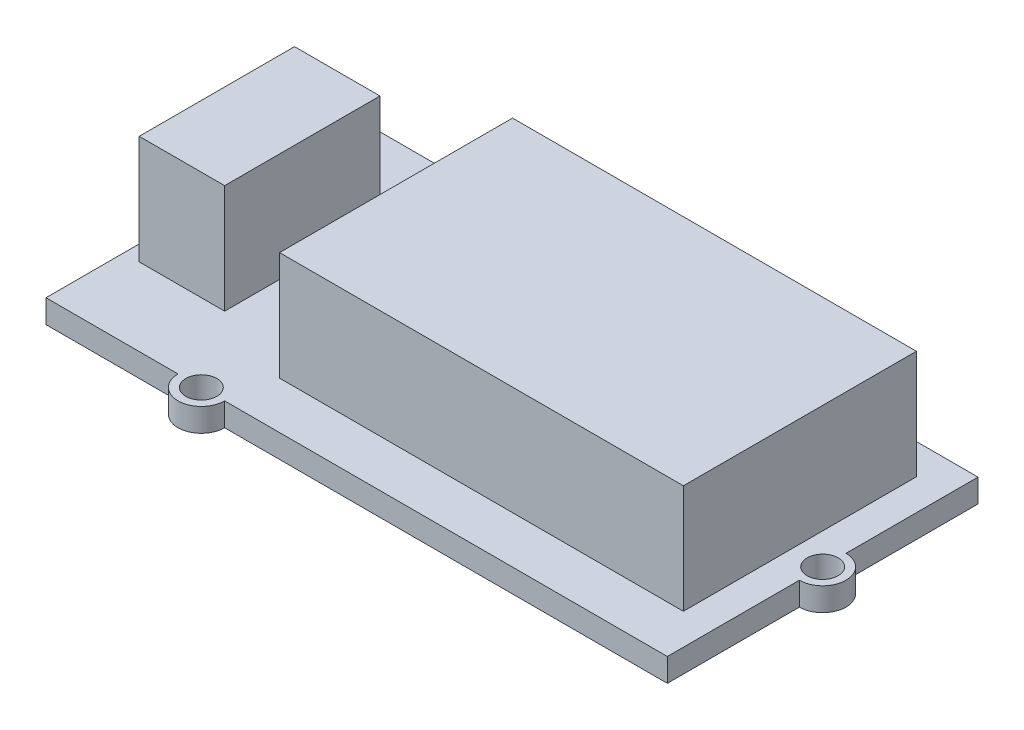
ISO-10303-21;
HEADER;
FILE_DESCRIPTION(('STEP AP214'),'2;1');
FILE_NAME('part.step','',(''),(''),'','','');
FILE_SCHEMA(('AUTOMOTIVE_DESIGN { 1 0 10303 214 1 1 1 1 }'));
ENDSEC;
DATA;
#1=APPLICATION_CONTEXT('core data for automotive mechanical design processes');
#2=APPLICATION_PROTOCOL_DEFINITION('international standard','automotive_design',2000,#1);
#3=PRODUCT_CONTEXT('',#1,'mechanical');
#4=PRODUCT('Part','Part','',(#3));
#5=PRODUCT_RELATED_PRODUCT_CATEGORY('part','',(#4));
#6=PRODUCT_DEFINITION_FORMATION('','',#4);
#7=PRODUCT_DEFINITION_CONTEXT('part definition',#1,'design');
#8=PRODUCT_DEFINITION('design','',#6,#7);
#9=PRODUCT_DEFINITION_SHAPE('','',#8);
#10=(LENGTH_UNIT() NAMED_UNIT(*) SI_UNIT(.MILLI.,.METRE.));
#11=(NAMED_UNIT(*) PLANE_ANGLE_UNIT() SI_UNIT($,.RADIAN.));
#12=(NAMED_UNIT(*) SI_UNIT($,.STERADIAN.) SOLID_ANGLE_UNIT());
#13=UNCERTAINTY_MEASURE_WITH_UNIT(LENGTH_MEASURE(1.E-05),#10,'distance_accuracy_value','');
#14=(GEOMETRIC_REPRESENTATION_CONTEXT(3) GLOBAL_UNCERTAINTY_ASSIGNED_CONTEXT((#13)) GLOBAL_UNIT_ASSIGNED_CONTEXT((#10,
#11,#12)) REPRESENTATION_CONTEXT('',''));
#15=CARTESIAN_POINT('',(0.,0.,0.));
#16=DIRECTION('',(0.,0.,1.));
#17=DIRECTION('',(1.,0.,0.));
#18=AXIS2_PLACEMENT_3D('',#15,#16,#17);
#19=CARTESIAN_POINT('',(0.,1.5,0.));
#20=DIRECTION('',(0.,1.,0.));
#21=DIRECTION('',(0.,0.,1.));
#22=AXIS2_PLACEMENT_3D('',#19,#20,#21);
#23=PLANE('',#22);
#24=CARTESIAN_POINT('',(-10.,1.5,-10.));
#25=DIRECTION('',(0.,1.,0.));
#26=DIRECTION('',(0.,0.,1.));
#27=AXIS2_PLACEMENT_3D('',#24,#25,#26);
#28=CIRCLE('',#27,1.);
#29=CARTESIAN_POINT('',(-10.,1.5,-9.));
#30=VERTEX_POINT('',#29);
#31=EDGE_CURVE('E215',#30,#30,#28,.T.);
#32=ORIENTED_EDGE('',*,*,#31,.F.);
#33=EDGE_LOOP('',(#32));
#34=FACE_BOUND('',#33,.T.);
#35=CARTESIAN_POINT('',(20.,1.5,0.));
#36=DIRECTION('',(0.,1.,0.));
#37=DIRECTION('',(0.,0.,1.));
#38=AXIS2_PLACEMENT_3D('',#35,#36,#37);
#39=CIRCLE('',#38,1.);
#40=CARTESIAN_POINT('',(20.,1.5,1.));
#41=VERTEX_POINT('',#40);
#42=EDGE_CURVE('E219',#41,#41,#39,.T.);
#43=ORIENTED_EDGE('',*,*,#42,.F.);
#44=EDGE_LOOP('',(#43));
#45=FACE_BOUND('',#44,.T.);
#46=CARTESIAN_POINT('',(-10.,1.5,10.));
#47=DIRECTION('',(0.,1.,0.));
#48=DIRECTION('',(0.,0.,1.));
#49=AXIS2_PLACEMENT_3D('',#46,#47,#48);
#50=CIRCLE('',#49,0.999999999999999);
#51=CARTESIAN_POINT('',(-10.,1.5,11.));
#52=VERTEX_POINT('',#51);
#53=EDGE_CURVE('E225',#52,#52,#50,.T.);
#54=ORIENTED_EDGE('',*,*,#53,.F.);
#55=EDGE_LOOP('',(#54));
#56=FACE_BOUND('',#55,.T.);
#57=DIRECTION('',(0.,0.,-1.));
#58=VECTOR('',#57,1.);
#59=CARTESIAN_POINT('',(20.,1.5,-10.));
#60=LINE('',#59,#58);
#61=CARTESIAN_POINT('',(20.,1.5,10.));
#62=VERTEX_POINT('',#61);
#63=CARTESIAN_POINT('',(20.,1.5,1.5));
#64=VERTEX_POINT('',#63);
#65=EDGE_CURVE('E264',#62,#64,#60,.T.);
#66=ORIENTED_EDGE('',*,*,#65,.T.);
#67=CARTESIAN_POINT('',(20.,1.5,0.));
#68=DIRECTION('',(0.,1.,0.));
#69=DIRECTION('',(0.,0.,1.));
#70=AXIS2_PLACEMENT_3D('',#67,#68,#69);
#71=CIRCLE('',#70,1.5);
#72=CARTESIAN_POINT('',(20.,1.5,-1.5));
#73=VERTEX_POINT('',#72);
#74=EDGE_CURVE('E231',#64,#73,#71,.T.);
#75=ORIENTED_EDGE('',*,*,#74,.T.);
#76=CARTESIAN_POINT('',(20.,1.5,-10.));
#77=VERTEX_POINT('',#76);
#78=EDGE_CURVE('E268',#73,#77,#60,.T.);
#79=ORIENTED_EDGE('',*,*,#78,.T.);
#80=DIRECTION('',(-1.,0.,0.));
#81=VECTOR('',#80,1.);
#82=CARTESIAN_POINT('',(-20.,1.5,-10.));
#83=LINE('',#82,#81);
#84=CARTESIAN_POINT('',(-8.5,1.5,-10.));
#85=VERTEX_POINT('',#84);
#86=EDGE_CURVE('E269',#77,#85,#83,.T.);
#87=ORIENTED_EDGE('',*,*,#86,.T.);
#88=CARTESIAN_POINT('',(-10.,1.5,-10.));
#89=DIRECTION('',(0.,1.,0.));
#90=DIRECTION('',(0.,0.,1.));
#91=AXIS2_PLACEMENT_3D('',#88,#89,#90);
#92=CIRCLE('',#91,1.5);
#93=CARTESIAN_POINT('',(-11.5,1.5,-10.));
#94=VERTEX_POINT('',#93);
#95=EDGE_CURVE('E253',#85,#94,#92,.T.);
#96=ORIENTED_EDGE('',*,*,#95,.T.);
#97=CARTESIAN_POINT('',(-20.,1.5,-10.));
#98=VERTEX_POINT('',#97);
#99=EDGE_CURVE('E267',#94,#98,#83,.T.);
#100=ORIENTED_EDGE('',*,*,#99,.T.);
#101=DIRECTION('',(0.,0.,1.));
#102=VECTOR('',#101,1.);
#103=CARTESIAN_POINT('',(-20.,1.5,-10.));
#104=LINE('',#103,#102);
#105=CARTESIAN_POINT('',(-20.,1.5,10.));
#106=VERTEX_POINT('',#105);
#107=EDGE_CURVE('E272',#98,#106,#104,.T.);
#108=ORIENTED_EDGE('',*,*,#107,.T.);
#109=DIRECTION('',(1.,0.,0.));
#110=VECTOR('',#109,1.);
#111=CARTESIAN_POINT('',(-20.,1.5,10.));
#112=LINE('',#111,#110);
#113=CARTESIAN_POINT('',(-11.5,1.5,10.));
#114=VERTEX_POINT('',#113);
#115=EDGE_CURVE('E275',#106,#114,#112,.T.);
#116=ORIENTED_EDGE('',*,*,#115,.T.);
#117=CARTESIAN_POINT('',(-10.,1.5,10.));
#118=DIRECTION('',(0.,1.,0.));
#119=DIRECTION('',(0.,0.,1.));
#120=AXIS2_PLACEMENT_3D('',#117,#118,#119);
#121=CIRCLE('',#120,1.5);
#122=CARTESIAN_POINT('',(-8.5,1.5,10.));
#123=VERTEX_POINT('',#122);
#124=EDGE_CURVE('E243',#114,#123,#121,.T.);
#125=ORIENTED_EDGE('',*,*,#124,.T.);
#126=EDGE_CURVE('E274',#123,#62,#112,.T.);
#127=ORIENTED_EDGE('',*,*,#126,.T.);
#128=EDGE_LOOP('',(#66,#75,#79,#87,#96,#100,#108,#116,#125,#127));
#129=FACE_BOUND('',#128,.T.);
#130=DIRECTION('',(-1.,0.,0.));
#131=VECTOR('',#130,1.);
#132=CARTESIAN_POINT('',(-19.,1.5,-5.));
#133=LINE('',#132,#131);
#134=CARTESIAN_POINT('',(-13.5,1.5,-5.));
#135=VERTEX_POINT('',#134);
#136=CARTESIAN_POINT('',(-19.,1.5,-5.));
#137=VERTEX_POINT('',#136);
#138=EDGE_CURVE('E187',#135,#137,#133,.T.);
#139=ORIENTED_EDGE('',*,*,#138,.F.);
#140=DIRECTION('',(0.,0.,-1.));
#141=VECTOR('',#140,1.);
#142=CARTESIAN_POINT('',(-13.5,1.5,-5.));
#143=LINE('',#142,#141);
#144=CARTESIAN_POINT('',(-13.5,1.5,5.));
#145=VERTEX_POINT('',#144);
#146=EDGE_CURVE('E184',#145,#135,#143,.T.);
#147=ORIENTED_EDGE('',*,*,#146,.F.);
#148=DIRECTION('',(1.,0.,0.));
#149=VECTOR('',#148,1.);
#150=CARTESIAN_POINT('',(-19.,1.5,5.));
#151=LINE('',#150,#149);
#152=CARTESIAN_POINT('',(-19.,1.5,5.));
#153=VERTEX_POINT('',#152);
#154=EDGE_CURVE('E196',#153,#145,#151,.T.);
#155=ORIENTED_EDGE('',*,*,#154,.F.);
#156=DIRECTION('',(0.,0.,1.));
#157=VECTOR('',#156,1.);
#158=CARTESIAN_POINT('',(-19.,1.5,-5.));
#159=LINE('',#158,#157);
#160=EDGE_CURVE('E204',#137,#153,#159,.T.);
#161=ORIENTED_EDGE('',*,*,#160,.F.);
#162=EDGE_LOOP('',(#139,#147,#155,#161));
#163=FACE_BOUND('',#162,.T.);
#164=DIRECTION('',(-1.,0.,0.));
#165=VECTOR('',#164,1.);
#166=CARTESIAN_POINT('',(-8.,1.5,-8.03388581005038));
#167=LINE('',#166,#165);
#168=CARTESIAN_POINT('',(18.,1.5,-8.03388581005038));
#169=VERTEX_POINT('',#168);
#170=CARTESIAN_POINT('',(-8.,1.5,-8.03388581005038));
#171=VERTEX_POINT('',#170);
#172=EDGE_CURVE('E559',#169,#171,#167,.T.);
#173=ORIENTED_EDGE('',*,*,#172,.F.);
#174=DIRECTION('',(0.,0.,-1.));
#175=VECTOR('',#174,1.);
#176=CARTESIAN_POINT('',(18.,1.5,-8.03388581005038));
#177=LINE('',#176,#175);
#178=CARTESIAN_POINT('',(18.,1.5,6.96611418994962));
#179=VERTEX_POINT('',#178);
#180=EDGE_CURVE('E182',#179,#169,#177,.T.);
#181=ORIENTED_EDGE('',*,*,#180,.F.);
#182=DIRECTION('',(1.,0.,0.));
#183=VECTOR('',#182,1.);
#184=CARTESIAN_POINT('',(-8.,1.5,6.96611418994962));
#185=LINE('',#184,#183);
#186=CARTESIAN_POINT('',(-8.,1.5,6.96611418994962));
#187=VERTEX_POINT('',#186);
#188=EDGE_CURVE('E178',#187,#179,#185,.T.);
#189=ORIENTED_EDGE('',*,*,#188,.F.);
#190=DIRECTION('',(0.,0.,1.));
#191=VECTOR('',#190,1.);
#192=CARTESIAN_POINT('',(-8.,1.5,-8.03388581005038));
#193=LINE('',#192,#191);
#194=EDGE_CURVE('E556',#171,#187,#193,.T.);
#195=ORIENTED_EDGE('',*,*,#194,.F.);
#196=EDGE_LOOP('',(#173,#181,#189,#195));
#197=FACE_BOUND('',#196,.T.);
#198=ADVANCED_FACE('F33',(#34,#45,#56,#129,#163,#197),#23,.T.);
#199=CARTESIAN_POINT('',(20.,1.5,-10.));
#200=DIRECTION('',(-1.,0.,0.));
#201=DIRECTION('',(0.,0.,1.));
#202=AXIS2_PLACEMENT_3D('',#199,#200,#201);
#203=PLANE('',#202);
#204=DIRECTION('',(0.,0.,-1.));
#205=VECTOR('',#204,1.);
#206=CARTESIAN_POINT('',(20.,0.,-10.));
#207=LINE('',#206,#205);
#208=CARTESIAN_POINT('',(20.,0.,10.));
#209=VERTEX_POINT('',#208);
#210=CARTESIAN_POINT('',(20.,0.,1.5));
#211=VERTEX_POINT('',#210);
#212=EDGE_CURVE('E279',#209,#211,#207,.T.);
#213=ORIENTED_EDGE('',*,*,#212,.T.);
#214=DIRECTION('',(0.,1.,0.));
#215=VECTOR('',#214,1.);
#216=CARTESIAN_POINT('',(20.,0.,1.5));
#217=LINE('',#216,#215);
#218=EDGE_CURVE('E240',#211,#64,#217,.T.);
#219=ORIENTED_EDGE('',*,*,#218,.T.);
#220=ORIENTED_EDGE('',*,*,#65,.F.);
#221=DIRECTION('',(0.,-1.,0.));
#222=VECTOR('',#221,1.);
#223=CARTESIAN_POINT('',(20.,1.5,10.));
#224=LINE('',#223,#222);
#225=EDGE_CURVE('E278',#62,#209,#224,.T.);
#226=ORIENTED_EDGE('',*,*,#225,.T.);
#227=EDGE_LOOP('',(#213,#219,#220,#226));
#228=FACE_BOUND('',#227,.T.);
#229=ADVANCED_FACE('F335',(#228),#203,.F.);
#230=CARTESIAN_POINT('',(-20.,1.5,10.));
#231=DIRECTION('',(0.,0.,-1.));
#232=DIRECTION('',(-1.,0.,0.));
#233=AXIS2_PLACEMENT_3D('',#230,#231,#232);
#234=PLANE('',#233);
#235=DIRECTION('',(1.,0.,0.));
#236=VECTOR('',#235,1.);
#237=CARTESIAN_POINT('',(-20.,0.,10.));
#238=LINE('',#237,#236);
#239=CARTESIAN_POINT('',(-20.,0.,10.));
#240=VERTEX_POINT('',#239);
#241=CARTESIAN_POINT('',(-11.5,0.,10.));
#242=VERTEX_POINT('',#241);
#243=EDGE_CURVE('E289',#240,#242,#238,.T.);
#244=ORIENTED_EDGE('',*,*,#243,.T.);
#245=DIRECTION('',(0.,1.,0.));
#246=VECTOR('',#245,1.);
#247=CARTESIAN_POINT('',(-11.5,0.,10.));
#248=LINE('',#247,#246);
#249=EDGE_CURVE('E250',#242,#114,#248,.T.);
#250=ORIENTED_EDGE('',*,*,#249,.T.);
#251=ORIENTED_EDGE('',*,*,#115,.F.);
#252=DIRECTION('',(0.,-1.,0.));
#253=VECTOR('',#252,1.);
#254=CARTESIAN_POINT('',(-20.,1.5,10.));
#255=LINE('',#254,#253);
#256=EDGE_CURVE('E294',#106,#240,#255,.T.);
#257=ORIENTED_EDGE('',*,*,#256,.T.);
#258=EDGE_LOOP('',(#244,#250,#251,#257));
#259=FACE_BOUND('',#258,.T.);
#260=ADVANCED_FACE('F314',(#259),#234,.F.);
#261=CARTESIAN_POINT('',(-20.,1.5,-10.));
#262=DIRECTION('',(0.,0.,1.));
#263=DIRECTION('',(1.,0.,0.));
#264=AXIS2_PLACEMENT_3D('',#261,#262,#263);
#265=PLANE('',#264);
#266=DIRECTION('',(-1.,0.,0.));
#267=VECTOR('',#266,1.);
#268=CARTESIAN_POINT('',(-20.,0.,-10.));
#269=LINE('',#268,#267);
#270=CARTESIAN_POINT('',(20.,0.,-10.));
#271=VERTEX_POINT('',#270);
#272=CARTESIAN_POINT('',(-8.5,0.,-10.));
#273=VERTEX_POINT('',#272);
#274=EDGE_CURVE('E283',#271,#273,#269,.T.);
#275=ORIENTED_EDGE('',*,*,#274,.T.);
#276=DIRECTION('',(0.,1.,0.));
#277=VECTOR('',#276,1.);
#278=CARTESIAN_POINT('',(-8.5,0.,-10.));
#279=LINE('',#278,#277);
#280=EDGE_CURVE('E260',#273,#85,#279,.T.);
#281=ORIENTED_EDGE('',*,*,#280,.T.);
#282=ORIENTED_EDGE('',*,*,#86,.F.);
#283=DIRECTION('',(0.,-1.,0.));
#284=VECTOR('',#283,1.);
#285=CARTESIAN_POINT('',(20.,1.5,-10.));
#286=LINE('',#285,#284);
#287=EDGE_CURVE('E11',#77,#271,#286,.T.);
#288=ORIENTED_EDGE('',*,*,#287,.T.);
#289=EDGE_LOOP('',(#275,#281,#282,#288));
#290=FACE_BOUND('',#289,.T.);
#291=ADVANCED_FACE('F325',(#290),#265,.F.);
#292=ORIENTED_EDGE('',*,*,#78,.F.);
#293=DIRECTION('',(0.,1.,0.));
#294=VECTOR('',#293,1.);
#295=CARTESIAN_POINT('',(20.,0.,-1.5));
#296=LINE('',#295,#294);
#297=CARTESIAN_POINT('',(20.,0.,-1.5));
#298=VERTEX_POINT('',#297);
#299=EDGE_CURVE('E236',#73,#298,#296,.F.);
#300=ORIENTED_EDGE('',*,*,#299,.T.);
#301=EDGE_CURVE('E263',#298,#271,#207,.T.);
#302=ORIENTED_EDGE('',*,*,#301,.T.);
#303=ORIENTED_EDGE('',*,*,#287,.F.);
#304=EDGE_LOOP('',(#292,#300,#302,#303));
#305=FACE_BOUND('',#304,.T.);
#306=ADVANCED_FACE('F35',(#305),#203,.F.);
#307=ORIENTED_EDGE('',*,*,#99,.F.);
#308=DIRECTION('',(0.,1.,0.));
#309=VECTOR('',#308,1.);
#310=CARTESIAN_POINT('',(-11.5,0.,-10.));
#311=LINE('',#310,#309);
#312=CARTESIAN_POINT('',(-11.5,0.,-10.));
#313=VERTEX_POINT('',#312);
#314=EDGE_CURVE('E256',#94,#313,#311,.F.);
#315=ORIENTED_EDGE('',*,*,#314,.T.);
#316=CARTESIAN_POINT('',(-20.,0.,-10.));
#317=VERTEX_POINT('',#316);
#318=EDGE_CURVE('E282',#313,#317,#269,.T.);
#319=ORIENTED_EDGE('',*,*,#318,.T.);
#320=DIRECTION('',(0.,-1.,0.));
#321=VECTOR('',#320,1.);
#322=CARTESIAN_POINT('',(-20.,1.5,-10.));
#323=LINE('',#322,#321);
#324=EDGE_CURVE('E41',#98,#317,#323,.T.);
#325=ORIENTED_EDGE('',*,*,#324,.F.);
#326=EDGE_LOOP('',(#307,#315,#319,#325));
#327=FACE_BOUND('',#326,.T.);
#328=ADVANCED_FACE('F320',(#327),#265,.F.);
#329=CARTESIAN_POINT('',(-20.,1.5,-10.));
#330=DIRECTION('',(1.,0.,0.));
#331=DIRECTION('',(0.,0.,-1.));
#332=AXIS2_PLACEMENT_3D('',#329,#330,#331);
#333=PLANE('',#332);
#334=DIRECTION('',(0.,0.,1.));
#335=VECTOR('',#334,1.);
#336=CARTESIAN_POINT('',(-20.,0.,-10.));
#337=LINE('',#336,#335);
#338=EDGE_CURVE('E286',#317,#240,#337,.T.);
#339=ORIENTED_EDGE('',*,*,#338,.T.);
#340=ORIENTED_EDGE('',*,*,#256,.F.);
#341=ORIENTED_EDGE('',*,*,#107,.F.);
#342=ORIENTED_EDGE('',*,*,#324,.T.);
#343=EDGE_LOOP('',(#339,#340,#341,#342));
#344=FACE_BOUND('',#343,.T.);
#345=ADVANCED_FACE('F301',(#344),#333,.F.);
#346=ORIENTED_EDGE('',*,*,#126,.F.);
#347=DIRECTION('',(0.,1.,0.));
#348=VECTOR('',#347,1.);
#349=CARTESIAN_POINT('',(-8.5,0.,10.));
#350=LINE('',#349,#348);
#351=CARTESIAN_POINT('',(-8.5,0.,10.));
#352=VERTEX_POINT('',#351);
#353=EDGE_CURVE('E246',#123,#352,#350,.F.);
#354=ORIENTED_EDGE('',*,*,#353,.T.);
#355=EDGE_CURVE('E288',#352,#209,#238,.T.);
#356=ORIENTED_EDGE('',*,*,#355,.T.);
#357=ORIENTED_EDGE('',*,*,#225,.F.);
#358=EDGE_LOOP('',(#346,#354,#356,#357));
#359=FACE_BOUND('',#358,.T.);
#360=ADVANCED_FACE('F340',(#359),#234,.F.);
#361=CARTESIAN_POINT('',(0.,0.,0.));
#362=DIRECTION('',(0.,1.,0.));
#363=DIRECTION('',(0.,0.,1.));
#364=AXIS2_PLACEMENT_3D('',#361,#362,#363);
#365=PLANE('',#364);
#366=CARTESIAN_POINT('',(-10.,0.,-10.));
#367=DIRECTION('',(0.,1.,0.));
#368=DIRECTION('',(0.,0.,1.));
#369=AXIS2_PLACEMENT_3D('',#366,#367,#368);
#370=CIRCLE('',#369,1.);
#371=CARTESIAN_POINT('',(-10.,0.,-9.));
#372=VERTEX_POINT('',#371);
#373=EDGE_CURVE('E216',#372,#372,#370,.T.);
#374=ORIENTED_EDGE('',*,*,#373,.T.);
#375=EDGE_LOOP('',(#374));
#376=FACE_BOUND('',#375,.T.);
#377=CARTESIAN_POINT('',(20.,0.,0.));
#378=DIRECTION('',(0.,1.,0.));
#379=DIRECTION('',(0.,0.,1.));
#380=AXIS2_PLACEMENT_3D('',#377,#378,#379);
#381=CIRCLE('',#380,1.);
#382=CARTESIAN_POINT('',(20.,0.,1.));
#383=VERTEX_POINT('',#382);
#384=EDGE_CURVE('E222',#383,#383,#381,.T.);
#385=ORIENTED_EDGE('',*,*,#384,.T.);
#386=EDGE_LOOP('',(#385));
#387=FACE_BOUND('',#386,.T.);
#388=CARTESIAN_POINT('',(-10.,0.,10.));
#389=DIRECTION('',(0.,1.,0.));
#390=DIRECTION('',(0.,0.,1.));
#391=AXIS2_PLACEMENT_3D('',#388,#389,#390);
#392=CIRCLE('',#391,0.999999999999999);
#393=CARTESIAN_POINT('',(-10.,0.,11.));
#394=VERTEX_POINT('',#393);
#395=EDGE_CURVE('E228',#394,#394,#392,.T.);
#396=ORIENTED_EDGE('',*,*,#395,.T.);
#397=EDGE_LOOP('',(#396));
#398=FACE_BOUND('',#397,.T.);
#399=ORIENTED_EDGE('',*,*,#301,.F.);
#400=CARTESIAN_POINT('',(20.,0.,0.));
#401=DIRECTION('',(0.,1.,0.));
#402=DIRECTION('',(0.,0.,1.));
#403=AXIS2_PLACEMENT_3D('',#400,#401,#402);
#404=CIRCLE('',#403,1.5);
#405=EDGE_CURVE('E234',#211,#298,#404,.T.);
#406=ORIENTED_EDGE('',*,*,#405,.F.);
#407=ORIENTED_EDGE('',*,*,#212,.F.);
#408=ORIENTED_EDGE('',*,*,#355,.F.);
#409=CARTESIAN_POINT('',(-10.,0.,10.));
#410=DIRECTION('',(0.,1.,0.));
#411=DIRECTION('',(0.,0.,1.));
#412=AXIS2_PLACEMENT_3D('',#409,#410,#411);
#413=CIRCLE('',#412,1.5);
#414=EDGE_CURVE('E244',#242,#352,#413,.T.);
#415=ORIENTED_EDGE('',*,*,#414,.F.);
#416=ORIENTED_EDGE('',*,*,#243,.F.);
#417=ORIENTED_EDGE('',*,*,#338,.F.);
#418=ORIENTED_EDGE('',*,*,#318,.F.);
#419=CARTESIAN_POINT('',(-10.,0.,-10.));
#420=DIRECTION('',(0.,1.,0.));
#421=DIRECTION('',(0.,0.,1.));
#422=AXIS2_PLACEMENT_3D('',#419,#420,#421);
#423=CIRCLE('',#422,1.5);
#424=EDGE_CURVE('E254',#273,#313,#423,.T.);
#425=ORIENTED_EDGE('',*,*,#424,.F.);
#426=ORIENTED_EDGE('',*,*,#274,.F.);
#427=EDGE_LOOP('',(#399,#406,#407,#408,#415,#416,#417,#418,#425,#426));
#428=FACE_BOUND('',#427,.T.);
#429=ADVANCED_FACE('F309',(#376,#387,#398,#428),#365,.F.);
#430=CARTESIAN_POINT('',(-10.,0.,-10.));
#431=DIRECTION('',(0.,1.,0.));
#432=DIRECTION('',(0.,0.,1.));
#433=AXIS2_PLACEMENT_3D('',#430,#431,#432);
#434=CYLINDRICAL_SURFACE('',#433,1.5);
#435=ORIENTED_EDGE('',*,*,#280,.F.);
#436=ORIENTED_EDGE('',*,*,#424,.T.);
#437=ORIENTED_EDGE('',*,*,#314,.F.);
#438=ORIENTED_EDGE('',*,*,#95,.F.);
#439=EDGE_LOOP('',(#435,#436,#437,#438));
#440=FACE_BOUND('',#439,.T.);
#441=ADVANCED_FACE('F322',(#440),#434,.T.);
#442=CARTESIAN_POINT('',(-10.,0.,10.));
#443=DIRECTION('',(0.,1.,0.));
#444=DIRECTION('',(0.,0.,1.));
#445=AXIS2_PLACEMENT_3D('',#442,#443,#444);
#446=CYLINDRICAL_SURFACE('',#445,1.5);
#447=ORIENTED_EDGE('',*,*,#249,.F.);
#448=ORIENTED_EDGE('',*,*,#414,.T.);
#449=ORIENTED_EDGE('',*,*,#353,.F.);
#450=ORIENTED_EDGE('',*,*,#124,.F.);
#451=EDGE_LOOP('',(#447,#448,#449,#450));
#452=FACE_BOUND('',#451,.T.);
#453=ADVANCED_FACE('F342',(#452),#446,.T.);
#454=CARTESIAN_POINT('',(20.,0.,0.));
#455=DIRECTION('',(0.,1.,0.));
#456=DIRECTION('',(0.,0.,1.));
#457=AXIS2_PLACEMENT_3D('',#454,#455,#456);
#458=CYLINDRICAL_SURFACE('',#457,1.5);
#459=ORIENTED_EDGE('',*,*,#218,.F.);
#460=ORIENTED_EDGE('',*,*,#405,.T.);
#461=ORIENTED_EDGE('',*,*,#299,.F.);
#462=ORIENTED_EDGE('',*,*,#74,.F.);
#463=EDGE_LOOP('',(#459,#460,#461,#462));
#464=FACE_BOUND('',#463,.T.);
#465=ADVANCED_FACE('F344',(#464),#458,.T.);
#466=CARTESIAN_POINT('',(-10.,0.,10.));
#467=DIRECTION('',(0.,1.,0.));
#468=DIRECTION('',(0.,0.,1.));
#469=AXIS2_PLACEMENT_3D('',#466,#467,#468);
#470=CYLINDRICAL_SURFACE('',#469,0.999999999999999);
#471=ORIENTED_EDGE('',*,*,#395,.F.);
#472=EDGE_LOOP('',(#471));
#473=FACE_BOUND('',#472,.T.);
#474=ORIENTED_EDGE('',*,*,#53,.T.);
#475=EDGE_LOOP('',(#474));
#476=FACE_BOUND('',#475,.T.);
#477=ADVANCED_FACE('F350',(#473,#476),#470,.F.);
#478=CARTESIAN_POINT('',(20.,0.,0.));
#479=DIRECTION('',(0.,1.,0.));
#480=DIRECTION('',(0.,0.,1.));
#481=AXIS2_PLACEMENT_3D('',#478,#479,#480);
#482=CYLINDRICAL_SURFACE('',#481,1.);
#483=ORIENTED_EDGE('',*,*,#384,.F.);
#484=EDGE_LOOP('',(#483));
#485=FACE_BOUND('',#484,.T.);
#486=ORIENTED_EDGE('',*,*,#42,.T.);
#487=EDGE_LOOP('',(#486));
#488=FACE_BOUND('',#487,.T.);
#489=ADVANCED_FACE('F423',(#485,#488),#482,.F.);
#490=CARTESIAN_POINT('',(-10.,0.,-10.));
#491=DIRECTION('',(0.,1.,0.));
#492=DIRECTION('',(0.,0.,1.));
#493=AXIS2_PLACEMENT_3D('',#490,#491,#492);
#494=CYLINDRICAL_SURFACE('',#493,1.);
#495=ORIENTED_EDGE('',*,*,#373,.F.);
#496=EDGE_LOOP('',(#495));
#497=FACE_BOUND('',#496,.T.);
#498=ORIENTED_EDGE('',*,*,#31,.T.);
#499=EDGE_LOOP('',(#498));
#500=FACE_BOUND('',#499,.T.);
#501=ADVANCED_FACE('F430',(#497,#500),#494,.F.);
#502=CARTESIAN_POINT('',(-13.5,8.5,-5.));
#503=DIRECTION('',(-1.,0.,0.));
#504=DIRECTION('',(0.,0.,1.));
#505=AXIS2_PLACEMENT_3D('',#502,#503,#504);
#506=PLANE('',#505);
#507=ORIENTED_EDGE('',*,*,#146,.T.);
#508=DIRECTION('',(0.,-1.,0.));
#509=VECTOR('',#508,1.);
#510=CARTESIAN_POINT('',(-13.5,8.5,-5.));
#511=LINE('',#510,#509);
#512=CARTESIAN_POINT('',(-13.5,8.5,-5.));
#513=VERTEX_POINT('',#512);
#514=EDGE_CURVE('E213',#513,#135,#511,.T.);
#515=ORIENTED_EDGE('',*,*,#514,.F.);
#516=DIRECTION('',(0.,0.,-1.));
#517=VECTOR('',#516,1.);
#518=CARTESIAN_POINT('',(-13.5,8.5,-5.));
#519=LINE('',#518,#517);
#520=CARTESIAN_POINT('',(-13.5,8.5,5.));
#521=VERTEX_POINT('',#520);
#522=EDGE_CURVE('E192',#521,#513,#519,.T.);
#523=ORIENTED_EDGE('',*,*,#522,.F.);
#524=DIRECTION('',(0.,-1.,0.));
#525=VECTOR('',#524,1.);
#526=CARTESIAN_POINT('',(-13.5,8.5,5.));
#527=LINE('',#526,#525);
#528=EDGE_CURVE('E201',#521,#145,#527,.T.);
#529=ORIENTED_EDGE('',*,*,#528,.T.);
#530=EDGE_LOOP('',(#507,#515,#523,#529));
#531=FACE_BOUND('',#530,.T.);
#532=ADVANCED_FACE('F438',(#531),#506,.F.);
#533=CARTESIAN_POINT('',(-19.,8.5,-5.));
#534=DIRECTION('',(0.,0.,1.));
#535=DIRECTION('',(1.,0.,0.));
#536=AXIS2_PLACEMENT_3D('',#533,#534,#535);
#537=PLANE('',#536);
#538=ORIENTED_EDGE('',*,*,#138,.T.);
#539=DIRECTION('',(0.,-1.,0.));
#540=VECTOR('',#539,1.);
#541=CARTESIAN_POINT('',(-19.,8.5,-5.));
#542=LINE('',#541,#540);
#543=CARTESIAN_POINT('',(-19.,8.5,-5.));
#544=VERTEX_POINT('',#543);
#545=EDGE_CURVE('E210',#544,#137,#542,.T.);
#546=ORIENTED_EDGE('',*,*,#545,.F.);
#547=DIRECTION('',(-1.,0.,0.));
#548=VECTOR('',#547,1.);
#549=CARTESIAN_POINT('',(-19.,8.5,-5.));
#550=LINE('',#549,#548);
#551=EDGE_CURVE('E195',#513,#544,#550,.T.);
#552=ORIENTED_EDGE('',*,*,#551,.F.);
#553=ORIENTED_EDGE('',*,*,#514,.T.);
#554=EDGE_LOOP('',(#538,#546,#552,#553));
#555=FACE_BOUND('',#554,.T.);
#556=ADVANCED_FACE('F446',(#555),#537,.F.);
#557=CARTESIAN_POINT('',(-19.,8.5,-5.));
#558=DIRECTION('',(1.,0.,0.));
#559=DIRECTION('',(0.,0.,-1.));
#560=AXIS2_PLACEMENT_3D('',#557,#558,#559);
#561=PLANE('',#560);
#562=ORIENTED_EDGE('',*,*,#160,.T.);
#563=DIRECTION('',(0.,-1.,0.));
#564=VECTOR('',#563,1.);
#565=CARTESIAN_POINT('',(-19.,8.5,5.));
#566=LINE('',#565,#564);
#567=CARTESIAN_POINT('',(-19.,8.5,5.));
#568=VERTEX_POINT('',#567);
#569=EDGE_CURVE('E56',#568,#153,#566,.T.);
#570=ORIENTED_EDGE('',*,*,#569,.F.);
#571=DIRECTION('',(0.,0.,1.));
#572=VECTOR('',#571,1.);
#573=CARTESIAN_POINT('',(-19.,8.5,-5.));
#574=LINE('',#573,#572);
#575=EDGE_CURVE('E198',#544,#568,#574,.T.);
#576=ORIENTED_EDGE('',*,*,#575,.F.);
#577=ORIENTED_EDGE('',*,*,#545,.T.);
#578=EDGE_LOOP('',(#562,#570,#576,#577));
#579=FACE_BOUND('',#578,.T.);
#580=ADVANCED_FACE('F454',(#579),#561,.F.);
#581=CARTESIAN_POINT('',(-19.,8.5,5.));
#582=DIRECTION('',(0.,0.,-1.));
#583=DIRECTION('',(-1.,0.,0.));
#584=AXIS2_PLACEMENT_3D('',#581,#582,#583);
#585=PLANE('',#584);
#586=ORIENTED_EDGE('',*,*,#154,.T.);
#587=ORIENTED_EDGE('',*,*,#528,.F.);
#588=DIRECTION('',(1.,0.,0.));
#589=VECTOR('',#588,1.);
#590=CARTESIAN_POINT('',(-19.,8.5,5.));
#591=LINE('',#590,#589);
#592=EDGE_CURVE('E200',#568,#521,#591,.T.);
#593=ORIENTED_EDGE('',*,*,#592,.F.);
#594=ORIENTED_EDGE('',*,*,#569,.T.);
#595=EDGE_LOOP('',(#586,#587,#593,#594));
#596=FACE_BOUND('',#595,.T.);
#597=ADVANCED_FACE('F462',(#596),#585,.F.);
#598=CARTESIAN_POINT('',(0.,8.5,0.));
#599=DIRECTION('',(0.,1.,0.));
#600=DIRECTION('',(0.,0.,1.));
#601=AXIS2_PLACEMENT_3D('',#598,#599,#600);
#602=PLANE('',#601);
#603=ORIENTED_EDGE('',*,*,#522,.T.);
#604=ORIENTED_EDGE('',*,*,#551,.T.);
#605=ORIENTED_EDGE('',*,*,#575,.T.);
#606=ORIENTED_EDGE('',*,*,#592,.T.);
#607=EDGE_LOOP('',(#603,#604,#605,#606));
#608=FACE_BOUND('',#607,.T.);
#609=ADVANCED_FACE('F470',(#608),#602,.T.);
#610=CARTESIAN_POINT('',(18.,8.5,-8.03388581005038));
#611=DIRECTION('',(-1.,0.,0.));
#612=DIRECTION('',(0.,0.,1.));
#613=AXIS2_PLACEMENT_3D('',#610,#611,#612);
#614=PLANE('',#613);
#615=ORIENTED_EDGE('',*,*,#180,.T.);
#616=DIRECTION('',(0.,-1.,0.));
#617=VECTOR('',#616,1.);
#618=CARTESIAN_POINT('',(18.,8.5,-8.03388581005038));
#619=LINE('',#618,#617);
#620=CARTESIAN_POINT('',(18.,8.5,-8.03388581005038));
#621=VERTEX_POINT('',#620);
#622=EDGE_CURVE('E163',#621,#169,#619,.T.);
#623=ORIENTED_EDGE('',*,*,#622,.F.);
#624=DIRECTION('',(0.,0.,-1.));
#625=VECTOR('',#624,1.);
#626=CARTESIAN_POINT('',(18.,8.5,-8.03388581005038));
#627=LINE('',#626,#625);
#628=CARTESIAN_POINT('',(18.,8.5,6.96611418994962));
#629=VERTEX_POINT('',#628);
#630=EDGE_CURVE('E170',#629,#621,#627,.T.);
#631=ORIENTED_EDGE('',*,*,#630,.F.);
#632=DIRECTION('',(0.,-1.,0.));
#633=VECTOR('',#632,1.);
#634=CARTESIAN_POINT('',(18.,8.5,6.96611418994962));
#635=LINE('',#634,#633);
#636=EDGE_CURVE('E553',#629,#179,#635,.T.);
#637=ORIENTED_EDGE('',*,*,#636,.T.);
#638=EDGE_LOOP('',(#615,#623,#631,#637));
#639=FACE_BOUND('',#638,.T.);
#640=ADVANCED_FACE('F180',(#639),#614,.F.);
#641=CARTESIAN_POINT('',(-8.,8.5,-8.03388581005038));
#642=DIRECTION('',(0.,0.,1.));
#643=DIRECTION('',(1.,0.,0.));
#644=AXIS2_PLACEMENT_3D('',#641,#642,#643);
#645=PLANE('',#644);
#646=ORIENTED_EDGE('',*,*,#172,.T.);
#647=DIRECTION('',(0.,-1.,0.));
#648=VECTOR('',#647,1.);
#649=CARTESIAN_POINT('',(-8.,8.5,-8.03388581005038));
#650=LINE('',#649,#648);
#651=CARTESIAN_POINT('',(-8.,8.5,-8.03388581005038));
#652=VERTEX_POINT('',#651);
#653=EDGE_CURVE('E166',#652,#171,#650,.T.);
#654=ORIENTED_EDGE('',*,*,#653,.F.);
#655=DIRECTION('',(-1.,0.,0.));
#656=VECTOR('',#655,1.);
#657=CARTESIAN_POINT('',(-8.,8.5,-8.03388581005038));
#658=LINE('',#657,#656);
#659=EDGE_CURVE('E159',#621,#652,#658,.T.);
#660=ORIENTED_EDGE('',*,*,#659,.F.);
#661=ORIENTED_EDGE('',*,*,#622,.T.);
#662=EDGE_LOOP('',(#646,#654,#660,#661));
#663=FACE_BOUND('',#662,.T.);
#664=ADVANCED_FACE('F161',(#663),#645,.F.);
#665=CARTESIAN_POINT('',(-8.,8.5,-8.03388581005038));
#666=DIRECTION('',(1.,0.,0.));
#667=DIRECTION('',(0.,0.,-1.));
#668=AXIS2_PLACEMENT_3D('',#665,#666,#667);
#669=PLANE('',#668);
#670=ORIENTED_EDGE('',*,*,#194,.T.);
#671=DIRECTION('',(0.,-1.,0.));
#672=VECTOR('',#671,1.);
#673=CARTESIAN_POINT('',(-8.,8.5,6.96611418994962));
#674=LINE('',#673,#672);
#675=CARTESIAN_POINT('',(-8.,8.5,6.96611418994962));
#676=VERTEX_POINT('',#675);
#677=EDGE_CURVE('E48',#676,#187,#674,.T.);
#678=ORIENTED_EDGE('',*,*,#677,.F.);
#679=DIRECTION('',(0.,0.,1.));
#680=VECTOR('',#679,1.);
#681=CARTESIAN_POINT('',(-8.,8.5,-8.03388581005038));
#682=LINE('',#681,#680);
#683=EDGE_CURVE('E169',#652,#676,#682,.T.);
#684=ORIENTED_EDGE('',*,*,#683,.F.);
#685=ORIENTED_EDGE('',*,*,#653,.T.);
#686=EDGE_LOOP('',(#670,#678,#684,#685));
#687=FACE_BOUND('',#686,.T.);
#688=ADVANCED_FACE('F490',(#687),#669,.F.);
#689=CARTESIAN_POINT('',(-8.,8.5,6.96611418994962));
#690=DIRECTION('',(0.,0.,-1.));
#691=DIRECTION('',(-1.,0.,0.));
#692=AXIS2_PLACEMENT_3D('',#689,#690,#691);
#693=PLANE('',#692);
#694=ORIENTED_EDGE('',*,*,#188,.T.);
#695=ORIENTED_EDGE('',*,*,#636,.F.);
#696=DIRECTION('',(1.,0.,0.));
#697=VECTOR('',#696,1.);
#698=CARTESIAN_POINT('',(-8.,8.5,6.96611418994962));
#699=LINE('',#698,#697);
#700=EDGE_CURVE('E174',#676,#629,#699,.T.);
#701=ORIENTED_EDGE('',*,*,#700,.F.);
#702=ORIENTED_EDGE('',*,*,#677,.T.);
#703=EDGE_LOOP('',(#694,#695,#701,#702));
#704=FACE_BOUND('',#703,.T.);
#705=ADVANCED_FACE('F497',(#704),#693,.F.);
#706=CARTESIAN_POINT('',(0.,8.5,0.));
#707=DIRECTION('',(0.,1.,0.));
#708=DIRECTION('',(0.,0.,1.));
#709=AXIS2_PLACEMENT_3D('',#706,#707,#708);
#710=PLANE('',#709);
#711=ORIENTED_EDGE('',*,*,#630,.T.);
#712=ORIENTED_EDGE('',*,*,#659,.T.);
#713=ORIENTED_EDGE('',*,*,#683,.T.);
#714=ORIENTED_EDGE('',*,*,#700,.T.);
#715=EDGE_LOOP('',(#711,#712,#713,#714));
#716=FACE_BOUND('',#715,.T.);
#717=ADVANCED_FACE('F173',(#716),#710,.T.);
#718=CLOSED_SHELL('',(#198,#229,#260,#291,#306,#328,#345,#360,#429,#441,#453,#465,#477,#489,
#501,#532,#556,#580,#597,#609,#640,#664,#688,#705,#717));
#719=MANIFOLD_SOLID_BREP('B2',#718);
#720=ADVANCED_BREP_SHAPE_REPRESENTATION('',(#18,#719),#14);
#721=SHAPE_DEFINITION_REPRESENTATION(#9,#720);
ENDSEC;
END-ISO-10303-21;
